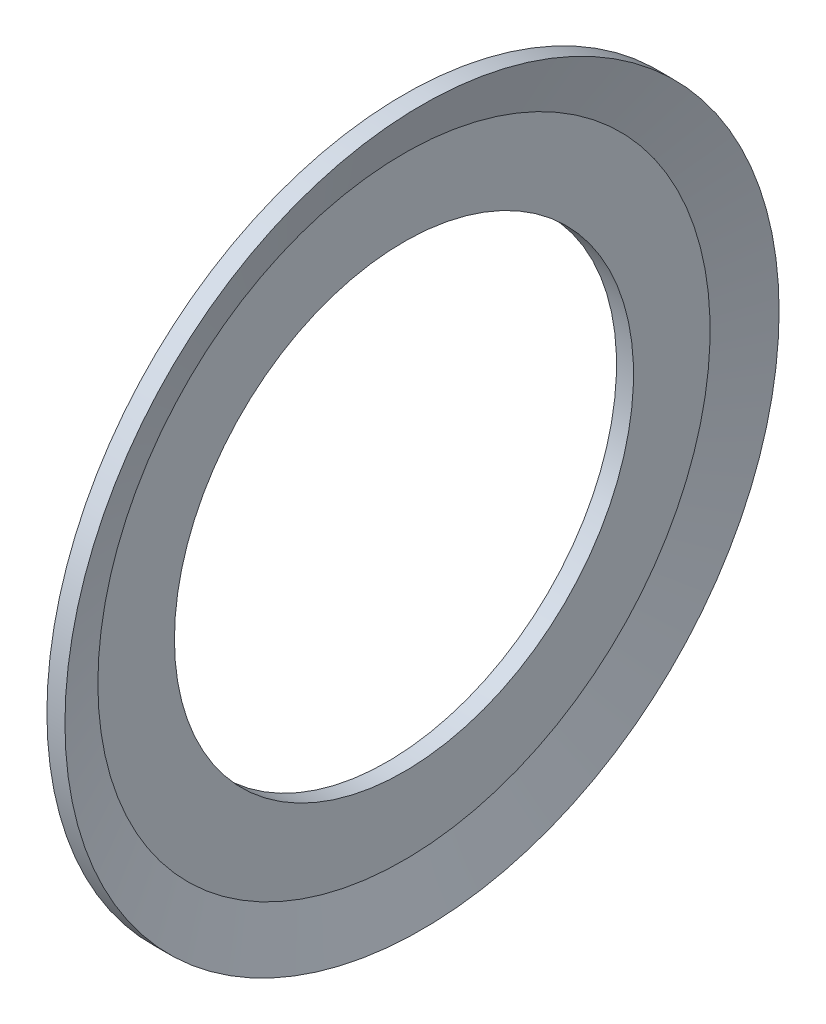
ISO-10303-21;
HEADER;
FILE_DESCRIPTION(('STEP AP214'),'2;1');
FILE_NAME('part.step','',(''),(''),'','','');
FILE_SCHEMA(('AUTOMOTIVE_DESIGN { 1 0 10303 214 1 1 1 1 }'));
ENDSEC;
DATA;
#1=APPLICATION_CONTEXT('core data for automotive mechanical design processes');
#2=APPLICATION_PROTOCOL_DEFINITION('international standard','automotive_design',2000,#1);
#3=PRODUCT_CONTEXT('',#1,'mechanical');
#4=PRODUCT('Part','Part','',(#3));
#5=PRODUCT_RELATED_PRODUCT_CATEGORY('part','',(#4));
#6=PRODUCT_DEFINITION_FORMATION('','',#4);
#7=PRODUCT_DEFINITION_CONTEXT('part definition',#1,'design');
#8=PRODUCT_DEFINITION('design','',#6,#7);
#9=PRODUCT_DEFINITION_SHAPE('','',#8);
#10=(LENGTH_UNIT() NAMED_UNIT(*) SI_UNIT(.MILLI.,.METRE.));
#11=(NAMED_UNIT(*) PLANE_ANGLE_UNIT() SI_UNIT($,.RADIAN.));
#12=(NAMED_UNIT(*) SI_UNIT($,.STERADIAN.) SOLID_ANGLE_UNIT());
#13=UNCERTAINTY_MEASURE_WITH_UNIT(LENGTH_MEASURE(1.E-05),#10,'distance_accuracy_value','');
#14=(GEOMETRIC_REPRESENTATION_CONTEXT(3) GLOBAL_UNCERTAINTY_ASSIGNED_CONTEXT((#13)) GLOBAL_UNIT_ASSIGNED_CONTEXT((#10,
#11,#12)) REPRESENTATION_CONTEXT('',''));
#15=CARTESIAN_POINT('',(0.,0.,0.));
#16=DIRECTION('',(0.,0.,1.));
#17=DIRECTION('',(1.,0.,0.));
#18=AXIS2_PLACEMENT_3D('',#15,#16,#17);
#19=CARTESIAN_POINT('',(0.,0.,0.));
#20=DIRECTION('',(-1.,0.,0.));
#21=DIRECTION('',(0.,0.,1.));
#22=AXIS2_PLACEMENT_3D('',#19,#20,#21);
#23=CYLINDRICAL_SURFACE('',#22,13.5);
#24=CARTESIAN_POINT('',(0.,0.,0.));
#25=DIRECTION('',(-1.,0.,0.));
#26=DIRECTION('',(0.,0.,1.));
#27=AXIS2_PLACEMENT_3D('',#24,#25,#26);
#28=CIRCLE('',#27,13.5);
#29=CARTESIAN_POINT('',(0.,0.,13.5));
#30=VERTEX_POINT('',#29);
#31=EDGE_CURVE('E52',#30,#30,#28,.T.);
#32=ORIENTED_EDGE('',*,*,#31,.T.);
#33=EDGE_LOOP('',(#32));
#34=FACE_BOUND('',#33,.T.);
#35=CARTESIAN_POINT('',(1.,0.,0.));
#36=DIRECTION('',(-1.,0.,0.));
#37=DIRECTION('',(0.,0.,1.));
#38=AXIS2_PLACEMENT_3D('',#35,#36,#37);
#39=CIRCLE('',#38,13.5);
#40=CARTESIAN_POINT('',(1.,0.,13.5));
#41=VERTEX_POINT('',#40);
#42=EDGE_CURVE('E10',#41,#41,#39,.T.);
#43=ORIENTED_EDGE('',*,*,#42,.F.);
#44=EDGE_LOOP('',(#43));
#45=FACE_BOUND('',#44,.T.);
#46=ADVANCED_FACE('F30',(#34,#45),#23,.F.);
#47=CARTESIAN_POINT('',(1.,18.0032584149185,0.));
#48=DIRECTION('',(1.,0.,0.));
#49=DIRECTION('',(0.,0.,-1.));
#50=AXIS2_PLACEMENT_3D('',#47,#48,#49);
#51=PLANE('',#50);
#52=ORIENTED_EDGE('',*,*,#42,.T.);
#53=EDGE_LOOP('',(#52));
#54=FACE_BOUND('',#53,.T.);
#55=CARTESIAN_POINT('',(1.,0.,0.));
#56=DIRECTION('',(-1.,0.,0.));
#57=DIRECTION('',(0.,0.,1.));
#58=AXIS2_PLACEMENT_3D('',#55,#56,#57);
#59=CIRCLE('',#58,18.0032584149185);
#60=CARTESIAN_POINT('',(1.,0.,18.0032584149185));
#61=VERTEX_POINT('',#60);
#62=EDGE_CURVE('E36',#61,#61,#59,.T.);
#63=ORIENTED_EDGE('',*,*,#62,.F.);
#64=EDGE_LOOP('',(#63));
#65=FACE_BOUND('',#64,.T.);
#66=ADVANCED_FACE('F70',(#54,#65),#51,.T.);
#67=CARTESIAN_POINT('',(2.06061327069679,0.,0.));
#68=DIRECTION('',(1.,0.,0.));
#69=DIRECTION('',(0.,0.,-1.));
#70=AXIS2_PLACEMENT_3D('',#67,#68,#69);
#71=CONICAL_SURFACE('',#70,21.,1.2306316555812);
#72=ORIENTED_EDGE('',*,*,#62,.T.);
#73=EDGE_LOOP('',(#72));
#74=FACE_BOUND('',#73,.T.);
#75=CARTESIAN_POINT('',(2.06061327069679,0.,0.));
#76=DIRECTION('',(-1.,0.,0.));
#77=DIRECTION('',(0.,0.,1.));
#78=AXIS2_PLACEMENT_3D('',#75,#76,#77);
#79=CIRCLE('',#78,21.);
#80=CARTESIAN_POINT('',(2.06061327069679,0.,21.));
#81=VERTEX_POINT('',#80);
#82=EDGE_CURVE('E40',#81,#81,#79,.T.);
#83=ORIENTED_EDGE('',*,*,#82,.F.);
#84=EDGE_LOOP('',(#83));
#85=FACE_BOUND('',#84,.T.);
#86=ADVANCED_FACE('F74',(#74,#85),#71,.F.);
#87=CARTESIAN_POINT('',(0.,0.,0.));
#88=DIRECTION('',(-1.,0.,0.));
#89=DIRECTION('',(0.,0.,1.));
#90=AXIS2_PLACEMENT_3D('',#87,#88,#89);
#91=CYLINDRICAL_SURFACE('',#90,21.);
#92=ORIENTED_EDGE('',*,*,#82,.T.);
#93=EDGE_LOOP('',(#92));
#94=FACE_BOUND('',#93,.T.);
#95=CARTESIAN_POINT('',(0.999830117029251,0.,0.));
#96=DIRECTION('',(-1.,0.,0.));
#97=DIRECTION('',(0.,0.,1.));
#98=AXIS2_PLACEMENT_3D('',#95,#96,#97);
#99=CIRCLE('',#98,21.);
#100=CARTESIAN_POINT('',(0.999830117029251,0.,21.));
#101=VERTEX_POINT('',#100);
#102=EDGE_CURVE('E44',#101,#101,#99,.T.);
#103=ORIENTED_EDGE('',*,*,#102,.F.);
#104=EDGE_LOOP('',(#103));
#105=FACE_BOUND('',#104,.T.);
#106=ADVANCED_FACE('F66',(#94,#105),#91,.T.);
#107=CARTESIAN_POINT('',(0.,0.,0.));
#108=DIRECTION('',(1.,0.,0.));
#109=DIRECTION('',(0.,0.,-1.));
#110=AXIS2_PLACEMENT_3D('',#107,#108,#109);
#111=CONICAL_SURFACE('',#110,18.175,1.2306316555812);
#112=ORIENTED_EDGE('',*,*,#102,.T.);
#113=EDGE_LOOP('',(#112));
#114=FACE_BOUND('',#113,.T.);
#115=CARTESIAN_POINT('',(0.,0.,0.));
#116=DIRECTION('',(-1.,0.,0.));
#117=DIRECTION('',(0.,0.,1.));
#118=AXIS2_PLACEMENT_3D('',#115,#116,#117);
#119=CIRCLE('',#118,18.175);
#120=CARTESIAN_POINT('',(0.,0.,18.175));
#121=VERTEX_POINT('',#120);
#122=EDGE_CURVE('E49',#121,#121,#119,.T.);
#123=ORIENTED_EDGE('',*,*,#122,.F.);
#124=EDGE_LOOP('',(#123));
#125=FACE_BOUND('',#124,.T.);
#126=ADVANCED_FACE('F60',(#114,#125),#111,.T.);
#127=CARTESIAN_POINT('',(0.,13.5,0.));
#128=DIRECTION('',(-1.,0.,0.));
#129=DIRECTION('',(0.,0.,1.));
#130=AXIS2_PLACEMENT_3D('',#127,#128,#129);
#131=PLANE('',#130);
#132=ORIENTED_EDGE('',*,*,#122,.T.);
#133=EDGE_LOOP('',(#132));
#134=FACE_BOUND('',#133,.T.);
#135=ORIENTED_EDGE('',*,*,#31,.F.);
#136=EDGE_LOOP('',(#135));
#137=FACE_BOUND('',#136,.T.);
#138=ADVANCED_FACE('F58',(#134,#137),#131,.T.);
#139=CLOSED_SHELL('',(#46,#66,#86,#106,#126,#138));
#140=MANIFOLD_SOLID_BREP('B2',#139);
#141=ADVANCED_BREP_SHAPE_REPRESENTATION('',(#18,#140),#14);
#142=SHAPE_DEFINITION_REPRESENTATION(#9,#141);
ENDSEC;
END-ISO-10303-21;
